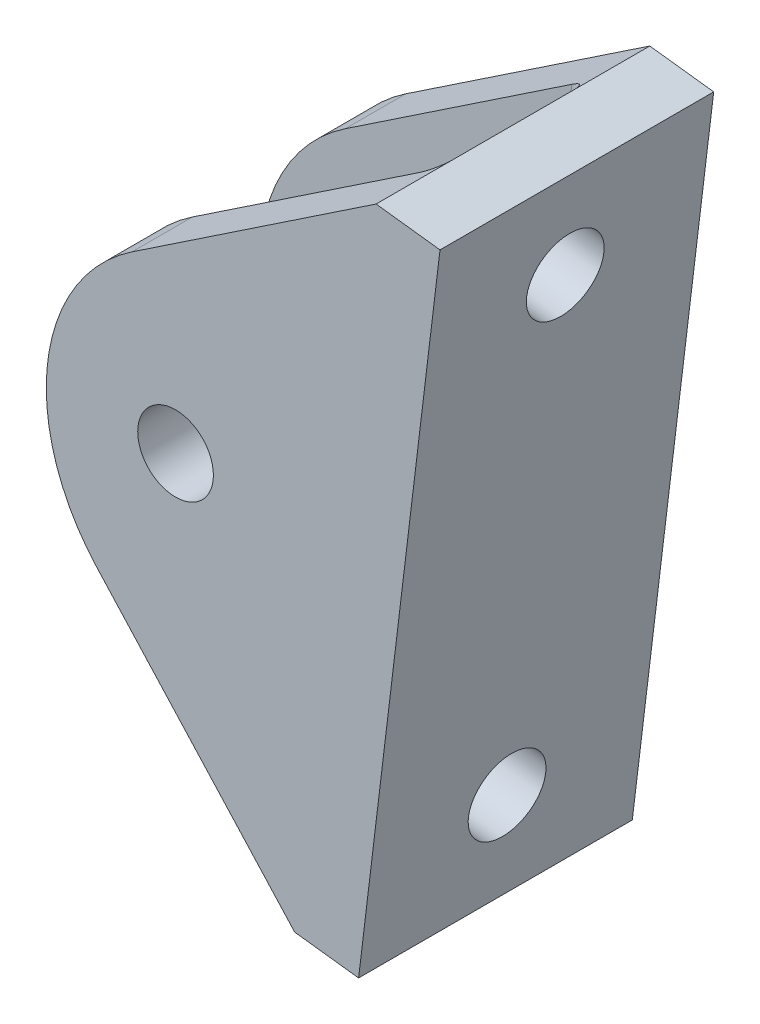
ISO-10303-21;
HEADER;
FILE_DESCRIPTION(('STEP AP214'),'2;1');
FILE_NAME('part.step','',(''),(''),'','','');
FILE_SCHEMA(('AUTOMOTIVE_DESIGN { 1 0 10303 214 1 1 1 1 }'));
ENDSEC;
DATA;
#1=APPLICATION_CONTEXT('core data for automotive mechanical design processes');
#2=APPLICATION_PROTOCOL_DEFINITION('international standard','automotive_design',2000,#1);
#3=PRODUCT_CONTEXT('',#1,'mechanical');
#4=PRODUCT('Part','Part','',(#3));
#5=PRODUCT_RELATED_PRODUCT_CATEGORY('part','',(#4));
#6=PRODUCT_DEFINITION_FORMATION('','',#4);
#7=PRODUCT_DEFINITION_CONTEXT('part definition',#1,'design');
#8=PRODUCT_DEFINITION('design','',#6,#7);
#9=PRODUCT_DEFINITION_SHAPE('','',#8);
#10=(LENGTH_UNIT() NAMED_UNIT(*) SI_UNIT(.MILLI.,.METRE.));
#11=(NAMED_UNIT(*) PLANE_ANGLE_UNIT() SI_UNIT($,.RADIAN.));
#12=(NAMED_UNIT(*) SI_UNIT($,.STERADIAN.) SOLID_ANGLE_UNIT());
#13=UNCERTAINTY_MEASURE_WITH_UNIT(LENGTH_MEASURE(1.E-05),#10,'distance_accuracy_value','');
#14=(GEOMETRIC_REPRESENTATION_CONTEXT(3) GLOBAL_UNCERTAINTY_ASSIGNED_CONTEXT((#13)) GLOBAL_UNIT_ASSIGNED_CONTEXT((#10,
#11,#12)) REPRESENTATION_CONTEXT('',''));
#15=CARTESIAN_POINT('',(0.,0.,0.));
#16=DIRECTION('',(0.,0.,1.));
#17=DIRECTION('',(1.,0.,0.));
#18=AXIS2_PLACEMENT_3D('',#15,#16,#17);
#19=CARTESIAN_POINT('',(-43.8883990487637,47.6307972317961,129.45));
#20=DIRECTION('',(0.55644779287138,-0.830882575222618,0.));
#21=DIRECTION('',(0.830882575222618,0.55644779287138,0.));
#22=AXIS2_PLACEMENT_3D('',#19,#20,#21);
#23=PLANE('',#22);
#24=DIRECTION('',(0.830882575222618,0.55644779287138,0.));
#25=VECTOR('',#24,1.);
#26=CARTESIAN_POINT('',(-43.8883990487637,47.6307972317961,125.7));
#27=LINE('',#26,#25);
#28=CARTESIAN_POINT('',(-59.0505832356892,37.4765778781606,125.7));
#29=VERTEX_POINT('',#28);
#30=CARTESIAN_POINT('',(-44.9847814916762,46.8965423458537,125.7));
#31=VERTEX_POINT('',#30);
#32=EDGE_CURVE('E172',#29,#31,#27,.T.);
#33=ORIENTED_EDGE('',*,*,#32,.F.);
#34=DIRECTION('',(0.,0.,-1.));
#35=VECTOR('',#34,1.);
#36=CARTESIAN_POINT('',(-59.0505832356892,37.4765778781606,129.45));
#37=LINE('',#36,#35);
#38=CARTESIAN_POINT('',(-59.0505832356892,37.4765778781606,129.45));
#39=VERTEX_POINT('',#38);
#40=EDGE_CURVE('E170',#39,#29,#37,.T.);
#41=ORIENTED_EDGE('',*,*,#40,.F.);
#42=DIRECTION('',(-0.830882575222618,-0.55644779287138,0.));
#43=VECTOR('',#42,1.);
#44=CARTESIAN_POINT('',(-43.8883990487637,47.6307972317961,129.45));
#45=LINE('',#44,#43);
#46=CARTESIAN_POINT('',(-43.8883990487637,47.6307972317961,129.45));
#47=VERTEX_POINT('',#46);
#48=EDGE_CURVE('E289',#47,#39,#45,.T.);
#49=ORIENTED_EDGE('',*,*,#48,.F.);
#50=DIRECTION('',(0.,0.,-1.));
#51=VECTOR('',#50,1.);
#52=CARTESIAN_POINT('',(-43.8883990487637,47.6307972317961,129.45));
#53=LINE('',#52,#51);
#54=CARTESIAN_POINT('',(-43.8883990487637,47.6307972317961,124.7));
#55=VERTEX_POINT('',#54);
#56=EDGE_CURVE('E191',#47,#55,#53,.T.);
#57=ORIENTED_EDGE('',*,*,#56,.T.);
#58=CARTESIAN_POINT('',(-44.9847814916762,46.8965423458537,124.7));
#59=DIRECTION('',(0.55644779287138,-0.830882575222618,0.));
#60=DIRECTION('',(0.830882575222618,0.55644779287138,0.));
#61=AXIS2_PLACEMENT_3D('',#58,#59,#60);
#62=ELLIPSE('',#61,1.31953957828363,1.);
#63=EDGE_CURVE('E221',#55,#31,#62,.T.);
#64=ORIENTED_EDGE('',*,*,#63,.T.);
#65=EDGE_LOOP('',(#33,#41,#49,#57,#64));
#66=FACE_BOUND('',#65,.T.);
#67=ADVANCED_FACE('F40',(#66),#23,.F.);
#68=CARTESIAN_POINT('',(-52.3732097212326,27.5059869754892,129.45));
#69=DIRECTION('',(0.,0.,-1.));
#70=DIRECTION('',(-1.,0.,0.));
#71=AXIS2_PLACEMENT_3D('',#68,#69,#70);
#72=CYLINDRICAL_SURFACE('',#71,12.);
#73=CARTESIAN_POINT('',(-52.3732097212326,27.5059869754892,125.7));
#74=DIRECTION('',(0.,0.,-1.));
#75=DIRECTION('',(-1.,0.,0.));
#76=AXIS2_PLACEMENT_3D('',#73,#74,#75);
#77=CIRCLE('',#76,12.);
#78=CARTESIAN_POINT('',(-61.2404899313599,19.4207323922936,125.7));
#79=VERTEX_POINT('',#78);
#80=EDGE_CURVE('E151',#79,#29,#77,.T.);
#81=ORIENTED_EDGE('',*,*,#80,.F.);
#82=DIRECTION('',(0.,0.,-1.));
#83=VECTOR('',#82,1.);
#84=CARTESIAN_POINT('',(-61.2404899313599,19.4207323922936,129.45));
#85=LINE('',#84,#83);
#86=CARTESIAN_POINT('',(-61.2404899313599,19.4207323922936,129.45));
#87=VERTEX_POINT('',#86);
#88=EDGE_CURVE('E167',#87,#79,#85,.T.);
#89=ORIENTED_EDGE('',*,*,#88,.F.);
#90=CARTESIAN_POINT('',(-52.3732097212326,27.5059869754892,129.45));
#91=DIRECTION('',(0.,0.,1.));
#92=DIRECTION('',(1.,0.,0.));
#93=AXIS2_PLACEMENT_3D('',#90,#91,#92);
#94=CIRCLE('',#93,12.);
#95=EDGE_CURVE('E292',#39,#87,#94,.T.);
#96=ORIENTED_EDGE('',*,*,#95,.F.);
#97=ORIENTED_EDGE('',*,*,#40,.T.);
#98=EDGE_LOOP('',(#81,#89,#96,#97));
#99=FACE_BOUND('',#98,.T.);
#100=ADVANCED_FACE('F165',(#99),#72,.T.);
#101=CARTESIAN_POINT('',(-61.2404899313599,19.4207323922936,129.45));
#102=DIRECTION('',(0.738940017510608,0.673771215266297,0.));
#103=DIRECTION('',(-0.673771215266297,0.738940017510608,0.));
#104=AXIS2_PLACEMENT_3D('',#101,#102,#103);
#105=PLANE('',#104);
#106=DIRECTION('',(-0.673771215266297,0.738940017510608,0.));
#107=VECTOR('',#106,1.);
#108=CARTESIAN_POINT('',(-61.2404899313599,19.4207323922936,125.7));
#109=LINE('',#108,#107);
#110=CARTESIAN_POINT('',(-49.8343868099661,6.91140303942213,125.7));
#111=VERTEX_POINT('',#110);
#112=EDGE_CURVE('E147',#111,#79,#109,.T.);
#113=ORIENTED_EDGE('',*,*,#112,.F.);
#114=CARTESIAN_POINT('',(-49.8343868099661,6.91140303942213,124.7));
#115=DIRECTION('',(0.738940017510608,0.673771215266297,0.));
#116=DIRECTION('',(-0.673771215266297,0.738940017510608,0.));
#117=AXIS2_PLACEMENT_3D('',#114,#115,#116);
#118=ELLIPSE('',#117,1.31953957828363,1.);
#119=CARTESIAN_POINT('',(-48.9453190247139,5.93634244033928,124.7));
#120=VERTEX_POINT('',#119);
#121=EDGE_CURVE('E224',#111,#120,#118,.T.);
#122=ORIENTED_EDGE('',*,*,#121,.T.);
#123=DIRECTION('',(0.,0.,-1.));
#124=VECTOR('',#123,1.);
#125=CARTESIAN_POINT('',(-48.9453190247139,5.93634244033928,129.45));
#126=LINE('',#125,#124);
#127=CARTESIAN_POINT('',(-48.9453190247139,5.93634244033928,129.45));
#128=VERTEX_POINT('',#127);
#129=EDGE_CURVE('E186',#128,#120,#126,.T.);
#130=ORIENTED_EDGE('',*,*,#129,.F.);
#131=DIRECTION('',(0.673771215266297,-0.738940017510608,0.));
#132=VECTOR('',#131,1.);
#133=CARTESIAN_POINT('',(-61.2404899313599,19.4207323922936,129.45));
#134=LINE('',#133,#132);
#135=EDGE_CURVE('E176',#87,#128,#134,.T.);
#136=ORIENTED_EDGE('',*,*,#135,.F.);
#137=ORIENTED_EDGE('',*,*,#88,.T.);
#138=EDGE_LOOP('',(#113,#122,#130,#136,#137));
#139=FACE_BOUND('',#138,.T.);
#140=ADVANCED_FACE('F174',(#139),#105,.F.);
#141=CARTESIAN_POINT('',(-56.3441101775619,27.9875984017701,129.45));
#142=DIRECTION('',(0.,0.,-1.));
#143=DIRECTION('',(-1.,0.,0.));
#144=AXIS2_PLACEMENT_3D('',#141,#142,#143);
#145=CYLINDRICAL_SURFACE('',#144,2.35);
#146=CARTESIAN_POINT('',(-56.3441101775619,27.9875984017701,129.45));
#147=DIRECTION('',(0.,0.,1.));
#148=DIRECTION('',(1.,0.,0.));
#149=AXIS2_PLACEMENT_3D('',#146,#147,#148);
#150=CIRCLE('',#149,2.35);
#151=CARTESIAN_POINT('',(-53.9941101775619,27.9875984017701,129.45));
#152=VERTEX_POINT('',#151);
#153=EDGE_CURVE('E273',#152,#152,#150,.T.);
#154=ORIENTED_EDGE('',*,*,#153,.T.);
#155=EDGE_LOOP('',(#154));
#156=FACE_BOUND('',#155,.T.);
#157=CARTESIAN_POINT('',(-56.3441101775619,27.9875984017701,125.7));
#158=DIRECTION('',(0.,0.,-1.));
#159=DIRECTION('',(-1.,0.,0.));
#160=AXIS2_PLACEMENT_3D('',#157,#158,#159);
#161=CIRCLE('',#160,2.35);
#162=CARTESIAN_POINT('',(-58.6941101775619,27.9875984017701,125.7));
#163=VERTEX_POINT('',#162);
#164=EDGE_CURVE('E160',#163,#163,#161,.T.);
#165=ORIENTED_EDGE('',*,*,#164,.T.);
#166=EDGE_LOOP('',(#165));
#167=FACE_BOUND('',#166,.T.);
#168=ADVANCED_FACE('F397',(#156,#167),#145,.F.);
#169=CARTESIAN_POINT('',(-52.3732097212326,27.5059869754892,129.45));
#170=DIRECTION('',(0.,0.,1.));
#171=DIRECTION('',(1.,0.,0.));
#172=AXIS2_PLACEMENT_3D('',#169,#170,#171);
#173=PLANE('',#172);
#174=DIRECTION('',(0.120402856570244,0.992725114082305,0.));
#175=VECTOR('',#174,1.);
#176=CARTESIAN_POINT('',(-39.9174985924345,47.1491858055151,129.45));
#177=LINE('',#176,#175);
#178=CARTESIAN_POINT('',(-44.9744185683847,5.45473101405832,129.45));
#179=VERTEX_POINT('',#178);
#180=CARTESIAN_POINT('',(-39.9174985924345,47.1491858055151,129.45));
#181=VERTEX_POINT('',#180);
#182=EDGE_CURVE('E281',#179,#181,#177,.T.);
#183=ORIENTED_EDGE('',*,*,#182,.T.);
#184=DIRECTION('',(-0.992725114082305,0.120402856570242,0.));
#185=VECTOR('',#184,1.);
#186=CARTESIAN_POINT('',(-43.8883990487637,47.6307972317961,129.45));
#187=LINE('',#186,#185);
#188=EDGE_CURVE('E285',#181,#47,#187,.T.);
#189=ORIENTED_EDGE('',*,*,#188,.T.);
#190=ORIENTED_EDGE('',*,*,#48,.T.);
#191=ORIENTED_EDGE('',*,*,#95,.T.);
#192=ORIENTED_EDGE('',*,*,#135,.T.);
#193=DIRECTION('',(0.992725114082305,-0.120402856570242,0.));
#194=VECTOR('',#193,1.);
#195=CARTESIAN_POINT('',(-44.9744185683847,5.45473101405832,129.45));
#196=LINE('',#195,#194);
#197=EDGE_CURVE('E295',#128,#179,#196,.T.);
#198=ORIENTED_EDGE('',*,*,#197,.T.);
#199=EDGE_LOOP('',(#183,#189,#190,#191,#192,#198));
#200=FACE_BOUND('',#199,.T.);
#201=ORIENTED_EDGE('',*,*,#153,.F.);
#202=EDGE_LOOP('',(#201));
#203=FACE_BOUND('',#202,.T.);
#204=ADVANCED_FACE('F390',(#200,#203),#173,.T.);
#205=CARTESIAN_POINT('',(-52.3732097212326,27.5059869754892,112.45));
#206=DIRECTION('',(0.,0.,1.));
#207=DIRECTION('',(1.,0.,0.));
#208=AXIS2_PLACEMENT_3D('',#205,#206,#207);
#209=PLANE('',#208);
#210=DIRECTION('',(0.120402856570244,0.992725114082305,0.));
#211=VECTOR('',#210,1.);
#212=CARTESIAN_POINT('',(-39.9174985924345,47.1491858055151,112.45));
#213=LINE('',#212,#211);
#214=CARTESIAN_POINT('',(-44.9744185683847,5.45473101405832,112.45));
#215=VERTEX_POINT('',#214);
#216=CARTESIAN_POINT('',(-39.9174985924345,47.1491858055151,112.45));
#217=VERTEX_POINT('',#216);
#218=EDGE_CURVE('E277',#215,#217,#213,.T.);
#219=ORIENTED_EDGE('',*,*,#218,.F.);
#220=DIRECTION('',(0.992725114082305,-0.120402856570242,0.));
#221=VECTOR('',#220,1.);
#222=CARTESIAN_POINT('',(-44.9744185683847,5.45473101405832,112.45));
#223=LINE('',#222,#221);
#224=CARTESIAN_POINT('',(-48.9453190247139,5.93634244033928,112.45));
#225=VERTEX_POINT('',#224);
#226=EDGE_CURVE('E286',#225,#215,#223,.T.);
#227=ORIENTED_EDGE('',*,*,#226,.F.);
#228=DIRECTION('',(0.673771215266297,-0.738940017510608,0.));
#229=VECTOR('',#228,1.);
#230=CARTESIAN_POINT('',(-61.2404899313599,19.4207323922936,112.45));
#231=LINE('',#230,#229);
#232=CARTESIAN_POINT('',(-61.2404899313599,19.4207323922936,112.45));
#233=VERTEX_POINT('',#232);
#234=EDGE_CURVE('E312',#233,#225,#231,.T.);
#235=ORIENTED_EDGE('',*,*,#234,.F.);
#236=CARTESIAN_POINT('',(-52.3732097212326,27.5059869754892,112.45));
#237=DIRECTION('',(0.,0.,1.));
#238=DIRECTION('',(1.,0.,0.));
#239=AXIS2_PLACEMENT_3D('',#236,#237,#238);
#240=CIRCLE('',#239,12.);
#241=CARTESIAN_POINT('',(-59.0505832356892,37.4765778781606,112.45));
#242=VERTEX_POINT('',#241);
#243=EDGE_CURVE('E308',#242,#233,#240,.T.);
#244=ORIENTED_EDGE('',*,*,#243,.F.);
#245=DIRECTION('',(-0.830882575222618,-0.55644779287138,0.));
#246=VECTOR('',#245,1.);
#247=CARTESIAN_POINT('',(-43.8883990487637,47.6307972317961,112.45));
#248=LINE('',#247,#246);
#249=CARTESIAN_POINT('',(-43.8883990487637,47.6307972317961,112.45));
#250=VERTEX_POINT('',#249);
#251=EDGE_CURVE('E305',#250,#242,#248,.T.);
#252=ORIENTED_EDGE('',*,*,#251,.F.);
#253=DIRECTION('',(-0.992725114082305,0.120402856570242,0.));
#254=VECTOR('',#253,1.);
#255=CARTESIAN_POINT('',(-43.8883990487637,47.6307972317961,112.45));
#256=LINE('',#255,#254);
#257=EDGE_CURVE('E302',#217,#250,#256,.T.);
#258=ORIENTED_EDGE('',*,*,#257,.F.);
#259=EDGE_LOOP('',(#219,#227,#235,#244,#252,#258));
#260=FACE_BOUND('',#259,.T.);
#261=CARTESIAN_POINT('',(-56.3441101775619,27.9875984017701,112.45));
#262=DIRECTION('',(0.,0.,1.));
#263=DIRECTION('',(1.,0.,0.));
#264=AXIS2_PLACEMENT_3D('',#261,#262,#263);
#265=CIRCLE('',#264,2.35);
#266=CARTESIAN_POINT('',(-53.9941101775619,27.9875984017701,112.45));
#267=VERTEX_POINT('',#266);
#268=EDGE_CURVE('E272',#267,#267,#265,.T.);
#269=ORIENTED_EDGE('',*,*,#268,.T.);
#270=EDGE_LOOP('',(#269));
#271=FACE_BOUND('',#270,.T.);
#272=ADVANCED_FACE('F374',(#260,#271),#209,.F.);
#273=CARTESIAN_POINT('',(-39.9174985924345,47.1491858055151,129.45));
#274=DIRECTION('',(-0.992725114082305,0.120402856570244,0.));
#275=DIRECTION('',(-0.120402856570244,-0.992725114082305,0.));
#276=AXIS2_PLACEMENT_3D('',#273,#274,#275);
#277=PLANE('',#276);
#278=CARTESIAN_POINT('',(-44.2520014289633,11.4110816985521,120.95));
#279=DIRECTION('',(-0.992725114082305,0.120402856570244,0.));
#280=DIRECTION('',(-0.120402856570244,-0.992725114082305,0.));
#281=AXIS2_PLACEMENT_3D('',#278,#279,#280);
#282=CIRCLE('',#281,2.4);
#283=CARTESIAN_POINT('',(-44.5409682847318,9.02854142475462,120.95));
#284=VERTEX_POINT('',#283);
#285=EDGE_CURVE('E326',#284,#284,#282,.T.);
#286=ORIENTED_EDGE('',*,*,#285,.T.);
#287=EDGE_LOOP('',(#286));
#288=FACE_BOUND('',#287,.T.);
#289=CARTESIAN_POINT('',(-40.639915731856,41.1928351210213,120.95));
#290=DIRECTION('',(-0.992725114082305,0.120402856570244,0.));
#291=DIRECTION('',(-0.120402856570244,-0.992725114082305,0.));
#292=AXIS2_PLACEMENT_3D('',#289,#290,#291);
#293=CIRCLE('',#292,2.4);
#294=CARTESIAN_POINT('',(-40.9288825876245,38.8102948472238,120.95));
#295=VERTEX_POINT('',#294);
#296=EDGE_CURVE('E253',#295,#295,#293,.T.);
#297=ORIENTED_EDGE('',*,*,#296,.T.);
#298=EDGE_LOOP('',(#297));
#299=FACE_BOUND('',#298,.T.);
#300=ORIENTED_EDGE('',*,*,#218,.T.);
#301=DIRECTION('',(0.,0.,-1.));
#302=VECTOR('',#301,1.);
#303=CARTESIAN_POINT('',(-39.9174985924345,47.1491858055151,129.45));
#304=LINE('',#303,#302);
#305=EDGE_CURVE('E194',#181,#217,#304,.T.);
#306=ORIENTED_EDGE('',*,*,#305,.F.);
#307=ORIENTED_EDGE('',*,*,#182,.F.);
#308=DIRECTION('',(0.,0.,-1.));
#309=VECTOR('',#308,1.);
#310=CARTESIAN_POINT('',(-44.9744185683847,5.45473101405832,129.45));
#311=LINE('',#310,#309);
#312=EDGE_CURVE('E298',#179,#215,#311,.T.);
#313=ORIENTED_EDGE('',*,*,#312,.T.);
#314=EDGE_LOOP('',(#300,#306,#307,#313));
#315=FACE_BOUND('',#314,.T.);
#316=ADVANCED_FACE('F370',(#288,#299,#315),#277,.F.);
#317=CARTESIAN_POINT('',(-43.8883990487637,47.6307972317961,129.45));
#318=DIRECTION('',(-0.120402856570242,-0.992725114082305,0.));
#319=DIRECTION('',(0.992725114082305,-0.120402856570242,0.));
#320=AXIS2_PLACEMENT_3D('',#317,#318,#319);
#321=PLANE('',#320);
#322=ORIENTED_EDGE('',*,*,#257,.T.);
#323=CARTESIAN_POINT('',(-43.8883990487637,47.6307972317961,117.2));
#324=VERTEX_POINT('',#323);
#325=EDGE_CURVE('E60',#324,#250,#53,.T.);
#326=ORIENTED_EDGE('',*,*,#325,.F.);
#327=DIRECTION('',(0.,0.,1.));
#328=VECTOR('',#327,1.);
#329=CARTESIAN_POINT('',(-43.8883990487637,47.6307972317961,116.2));
#330=LINE('',#329,#328);
#331=EDGE_CURVE('E202',#324,#55,#330,.T.);
#332=ORIENTED_EDGE('',*,*,#331,.T.);
#333=ORIENTED_EDGE('',*,*,#56,.F.);
#334=ORIENTED_EDGE('',*,*,#188,.F.);
#335=ORIENTED_EDGE('',*,*,#305,.T.);
#336=EDGE_LOOP('',(#322,#326,#332,#333,#334,#335));
#337=FACE_BOUND('',#336,.T.);
#338=ADVANCED_FACE('F363',(#337),#321,.F.);
#339=CARTESIAN_POINT('',(-59.0505832356892,37.4765778781606,116.2));
#340=VERTEX_POINT('',#339);
#341=EDGE_CURVE('E178',#340,#242,#37,.T.);
#342=ORIENTED_EDGE('',*,*,#341,.F.);
#343=DIRECTION('',(0.830882575222618,0.55644779287138,0.));
#344=VECTOR('',#343,1.);
#345=CARTESIAN_POINT('',(-43.8883990487637,47.6307972317961,116.2));
#346=LINE('',#345,#344);
#347=CARTESIAN_POINT('',(-44.9847814916762,46.8965423458537,116.2));
#348=VERTEX_POINT('',#347);
#349=EDGE_CURVE('E236',#340,#348,#346,.T.);
#350=ORIENTED_EDGE('',*,*,#349,.T.);
#351=CARTESIAN_POINT('',(-44.9847814916762,46.8965423458537,117.2));
#352=DIRECTION('',(0.55644779287138,-0.830882575222618,0.));
#353=DIRECTION('',(-0.830882575222618,-0.55644779287138,0.));
#354=AXIS2_PLACEMENT_3D('',#351,#352,#353);
#355=ELLIPSE('',#354,1.31953957828363,1.);
#356=EDGE_CURVE('E50',#348,#324,#355,.T.);
#357=ORIENTED_EDGE('',*,*,#356,.T.);
#358=ORIENTED_EDGE('',*,*,#325,.T.);
#359=ORIENTED_EDGE('',*,*,#251,.T.);
#360=EDGE_LOOP('',(#342,#350,#357,#358,#359));
#361=FACE_BOUND('',#360,.T.);
#362=ADVANCED_FACE('F234',(#361),#23,.F.);
#363=CARTESIAN_POINT('',(-61.2404899313599,19.4207323922936,116.2));
#364=VERTEX_POINT('',#363);
#365=EDGE_CURVE('E179',#364,#233,#85,.T.);
#366=ORIENTED_EDGE('',*,*,#365,.F.);
#367=CARTESIAN_POINT('',(-52.3732097212326,27.5059869754892,116.2));
#368=DIRECTION('',(0.,0.,-1.));
#369=DIRECTION('',(-1.,0.,0.));
#370=AXIS2_PLACEMENT_3D('',#367,#368,#369);
#371=CIRCLE('',#370,12.);
#372=EDGE_CURVE('E266',#364,#340,#371,.T.);
#373=ORIENTED_EDGE('',*,*,#372,.T.);
#374=ORIENTED_EDGE('',*,*,#341,.T.);
#375=ORIENTED_EDGE('',*,*,#243,.T.);
#376=EDGE_LOOP('',(#366,#373,#374,#375));
#377=FACE_BOUND('',#376,.T.);
#378=ADVANCED_FACE('F360',(#377),#72,.T.);
#379=CARTESIAN_POINT('',(-48.9453190247139,5.93634244033928,117.2));
#380=VERTEX_POINT('',#379);
#381=EDGE_CURVE('E249',#380,#225,#126,.T.);
#382=ORIENTED_EDGE('',*,*,#381,.F.);
#383=CARTESIAN_POINT('',(-49.8343868099661,6.91140303942213,117.2));
#384=DIRECTION('',(0.738940017510608,0.673771215266297,0.));
#385=DIRECTION('',(0.673771215266297,-0.738940017510608,0.));
#386=AXIS2_PLACEMENT_3D('',#383,#384,#385);
#387=ELLIPSE('',#386,1.31953957828363,1.);
#388=CARTESIAN_POINT('',(-49.8343868099661,6.91140303942213,116.2));
#389=VERTEX_POINT('',#388);
#390=EDGE_CURVE('E11',#380,#389,#387,.T.);
#391=ORIENTED_EDGE('',*,*,#390,.T.);
#392=DIRECTION('',(-0.673771215266297,0.738940017510608,0.));
#393=VECTOR('',#392,1.);
#394=CARTESIAN_POINT('',(-61.2404899313599,19.4207323922936,116.2));
#395=LINE('',#394,#393);
#396=EDGE_CURVE('E207',#389,#364,#395,.T.);
#397=ORIENTED_EDGE('',*,*,#396,.T.);
#398=ORIENTED_EDGE('',*,*,#365,.T.);
#399=ORIENTED_EDGE('',*,*,#234,.T.);
#400=EDGE_LOOP('',(#382,#391,#397,#398,#399));
#401=FACE_BOUND('',#400,.T.);
#402=ADVANCED_FACE('F368',(#401),#105,.F.);
#403=CARTESIAN_POINT('',(-44.9744185683847,5.45473101405832,129.45));
#404=DIRECTION('',(0.120402856570242,0.992725114082305,0.));
#405=DIRECTION('',(-0.992725114082305,0.120402856570242,0.));
#406=AXIS2_PLACEMENT_3D('',#403,#404,#405);
#407=PLANE('',#406);
#408=ORIENTED_EDGE('',*,*,#226,.T.);
#409=ORIENTED_EDGE('',*,*,#312,.F.);
#410=ORIENTED_EDGE('',*,*,#197,.F.);
#411=ORIENTED_EDGE('',*,*,#129,.T.);
#412=DIRECTION('',(0.,0.,1.));
#413=VECTOR('',#412,1.);
#414=CARTESIAN_POINT('',(-48.9453190247139,5.93634244033928,116.2));
#415=LINE('',#414,#413);
#416=EDGE_CURVE('E244',#380,#120,#415,.T.);
#417=ORIENTED_EDGE('',*,*,#416,.F.);
#418=ORIENTED_EDGE('',*,*,#381,.T.);
#419=EDGE_LOOP('',(#408,#409,#410,#411,#417,#418));
#420=FACE_BOUND('',#419,.T.);
#421=ADVANCED_FACE('F248',(#420),#407,.F.);
#422=CARTESIAN_POINT('',(-56.3441101775619,27.9875984017701,116.2));
#423=DIRECTION('',(0.,0.,-1.));
#424=DIRECTION('',(-1.,0.,0.));
#425=AXIS2_PLACEMENT_3D('',#422,#423,#424);
#426=CIRCLE('',#425,2.35);
#427=CARTESIAN_POINT('',(-58.6941101775619,27.9875984017701,116.2));
#428=VERTEX_POINT('',#427);
#429=EDGE_CURVE('E203',#428,#428,#426,.T.);
#430=ORIENTED_EDGE('',*,*,#429,.F.);
#431=EDGE_LOOP('',(#430));
#432=FACE_BOUND('',#431,.T.);
#433=ORIENTED_EDGE('',*,*,#268,.F.);
#434=EDGE_LOOP('',(#433));
#435=FACE_BOUND('',#434,.T.);
#436=ADVANCED_FACE('F403',(#432,#435),#145,.F.);
#437=CARTESIAN_POINT('',(0.,0.,116.2));
#438=DIRECTION('',(0.,0.,-1.));
#439=DIRECTION('',(-1.,0.,0.));
#440=AXIS2_PLACEMENT_3D('',#437,#438,#439);
#441=PLANE('',#440);
#442=ORIENTED_EDGE('',*,*,#429,.T.);
#443=EDGE_LOOP('',(#442));
#444=FACE_BOUND('',#443,.T.);
#445=ORIENTED_EDGE('',*,*,#396,.F.);
#446=DIRECTION('',(0.120402856570244,0.992725114082305,0.));
#447=VECTOR('',#446,1.);
#448=CARTESIAN_POINT('',(-44.881124162846,47.7512000883663,116.2));
#449=LINE('',#448,#447);
#450=EDGE_CURVE('E217',#389,#348,#449,.T.);
#451=ORIENTED_EDGE('',*,*,#450,.T.);
#452=ORIENTED_EDGE('',*,*,#349,.F.);
#453=ORIENTED_EDGE('',*,*,#372,.F.);
#454=EDGE_LOOP('',(#445,#451,#452,#453));
#455=FACE_BOUND('',#454,.T.);
#456=ADVANCED_FACE('F349',(#444,#455),#441,.F.);
#457=CARTESIAN_POINT('',(0.,0.,125.7));
#458=DIRECTION('',(0.,0.,-1.));
#459=DIRECTION('',(-1.,0.,0.));
#460=AXIS2_PLACEMENT_3D('',#457,#458,#459);
#461=PLANE('',#460);
#462=ORIENTED_EDGE('',*,*,#164,.F.);
#463=EDGE_LOOP('',(#462));
#464=FACE_BOUND('',#463,.T.);
#465=ORIENTED_EDGE('',*,*,#32,.T.);
#466=DIRECTION('',(0.120402856570244,0.992725114082305,0.));
#467=VECTOR('',#466,1.);
#468=CARTESIAN_POINT('',(-49.9380441387962,6.05674529690954,125.7));
#469=LINE('',#468,#467);
#470=EDGE_CURVE('E154',#31,#111,#469,.F.);
#471=ORIENTED_EDGE('',*,*,#470,.T.);
#472=ORIENTED_EDGE('',*,*,#112,.T.);
#473=ORIENTED_EDGE('',*,*,#80,.T.);
#474=EDGE_LOOP('',(#465,#471,#472,#473));
#475=FACE_BOUND('',#474,.T.);
#476=ADVANCED_FACE('F150',(#464,#475),#461,.T.);
#477=CARTESIAN_POINT('',(-48.9453190247139,5.93634244033928,116.2));
#478=DIRECTION('',(0.992725114082305,-0.120402856570244,0.));
#479=DIRECTION('',(0.120402856570244,0.992725114082305,0.));
#480=AXIS2_PLACEMENT_3D('',#477,#478,#479);
#481=PLANE('',#480);
#482=CARTESIAN_POINT('',(-48.2229018852925,11.8926931248331,120.95));
#483=DIRECTION('',(-0.992725114082305,0.120402856570244,0.));
#484=DIRECTION('',(-0.120402856570244,-0.992725114082305,0.));
#485=AXIS2_PLACEMENT_3D('',#482,#483,#484);
#486=CIRCLE('',#485,2.4);
#487=CARTESIAN_POINT('',(-48.5118687410611,9.51015285103559,120.95));
#488=VERTEX_POINT('',#487);
#489=EDGE_CURVE('E324',#488,#488,#486,.T.);
#490=ORIENTED_EDGE('',*,*,#489,.F.);
#491=EDGE_LOOP('',(#490));
#492=FACE_BOUND('',#491,.T.);
#493=CARTESIAN_POINT('',(-44.6108161881852,41.6744465473023,120.95));
#494=DIRECTION('',(-0.992725114082305,0.120402856570244,0.));
#495=DIRECTION('',(-0.120402856570244,-0.992725114082305,0.));
#496=AXIS2_PLACEMENT_3D('',#493,#494,#495);
#497=CIRCLE('',#496,2.4);
#498=CARTESIAN_POINT('',(-44.8997830439537,39.2919062735047,120.95));
#499=VERTEX_POINT('',#498);
#500=EDGE_CURVE('E259',#499,#499,#497,.T.);
#501=ORIENTED_EDGE('',*,*,#500,.F.);
#502=EDGE_LOOP('',(#501));
#503=FACE_BOUND('',#502,.T.);
#504=ORIENTED_EDGE('',*,*,#416,.T.);
#505=DIRECTION('',(0.120402856570244,0.992725114082305,0.));
#506=VECTOR('',#505,1.);
#507=CARTESIAN_POINT('',(-48.9453190247139,5.93634244033928,124.7));
#508=LINE('',#507,#506);
#509=EDGE_CURVE('E211',#120,#55,#508,.T.);
#510=ORIENTED_EDGE('',*,*,#509,.T.);
#511=ORIENTED_EDGE('',*,*,#331,.F.);
#512=DIRECTION('',(0.120402856570244,0.992725114082305,0.));
#513=VECTOR('',#512,1.);
#514=CARTESIAN_POINT('',(-48.9453190247139,5.93634244033928,117.2));
#515=LINE('',#514,#513);
#516=EDGE_CURVE('E198',#324,#380,#515,.F.);
#517=ORIENTED_EDGE('',*,*,#516,.T.);
#518=EDGE_LOOP('',(#504,#510,#511,#517));
#519=FACE_BOUND('',#518,.T.);
#520=ADVANCED_FACE('F243',(#492,#503,#519),#481,.F.);
#521=CARTESIAN_POINT('',(-49.9380441387962,6.05674529690953,124.7));
#522=DIRECTION('',(0.120402856570244,0.992725114082305,0.));
#523=DIRECTION('',(-0.992725114082305,0.120402856570244,0.));
#524=AXIS2_PLACEMENT_3D('',#521,#522,#523);
#525=CYLINDRICAL_SURFACE('',#524,1.);
#526=ORIENTED_EDGE('',*,*,#121,.F.);
#527=ORIENTED_EDGE('',*,*,#470,.F.);
#528=ORIENTED_EDGE('',*,*,#63,.F.);
#529=ORIENTED_EDGE('',*,*,#509,.F.);
#530=EDGE_LOOP('',(#526,#527,#528,#529));
#531=FACE_BOUND('',#530,.T.);
#532=ADVANCED_FACE('F341',(#531),#525,.F.);
#533=CARTESIAN_POINT('',(-49.9380441387962,6.05674529690954,117.2));
#534=DIRECTION('',(-0.120402856570244,-0.992725114082305,0.));
#535=DIRECTION('',(0.992725114082305,-0.120402856570244,0.));
#536=AXIS2_PLACEMENT_3D('',#533,#534,#535);
#537=CYLINDRICAL_SURFACE('',#536,1.);
#538=ORIENTED_EDGE('',*,*,#390,.F.);
#539=ORIENTED_EDGE('',*,*,#516,.F.);
#540=ORIENTED_EDGE('',*,*,#356,.F.);
#541=ORIENTED_EDGE('',*,*,#450,.F.);
#542=EDGE_LOOP('',(#538,#539,#540,#541));
#543=FACE_BOUND('',#542,.T.);
#544=ADVANCED_FACE('F42',(#543),#537,.F.);
#545=CARTESIAN_POINT('',(-44.6108161881852,41.6744465473023,120.95));
#546=DIRECTION('',(-0.992725114082305,0.120402856570244,0.));
#547=DIRECTION('',(-0.120402856570244,-0.992725114082305,0.));
#548=AXIS2_PLACEMENT_3D('',#545,#546,#547);
#549=CYLINDRICAL_SURFACE('',#548,2.4);
#550=ORIENTED_EDGE('',*,*,#296,.F.);
#551=EDGE_LOOP('',(#550));
#552=FACE_BOUND('',#551,.T.);
#553=ORIENTED_EDGE('',*,*,#500,.T.);
#554=EDGE_LOOP('',(#553));
#555=FACE_BOUND('',#554,.T.);
#556=ADVANCED_FACE('F338',(#552,#555),#549,.F.);
#557=CARTESIAN_POINT('',(-48.2229018852925,11.8926931248331,120.95));
#558=DIRECTION('',(-0.992725114082305,0.120402856570244,0.));
#559=DIRECTION('',(-0.120402856570244,-0.992725114082305,0.));
#560=AXIS2_PLACEMENT_3D('',#557,#558,#559);
#561=CYLINDRICAL_SURFACE('',#560,2.4);
#562=ORIENTED_EDGE('',*,*,#285,.F.);
#563=EDGE_LOOP('',(#562));
#564=FACE_BOUND('',#563,.T.);
#565=ORIENTED_EDGE('',*,*,#489,.T.);
#566=EDGE_LOOP('',(#565));
#567=FACE_BOUND('',#566,.T.);
#568=ADVANCED_FACE('F488',(#564,#567),#561,.F.);
#569=CLOSED_SHELL('',(#67,#100,#140,#168,#204,#272,#316,#338,#362,#378,#402,#421,#436,#456,#476,
#520,#532,#544,#556,#568));
#570=MANIFOLD_SOLID_BREP('B2',#569);
#571=ADVANCED_BREP_SHAPE_REPRESENTATION('',(#18,#570),#14);
#572=SHAPE_DEFINITION_REPRESENTATION(#9,#571);
ENDSEC;
END-ISO-10303-21;
